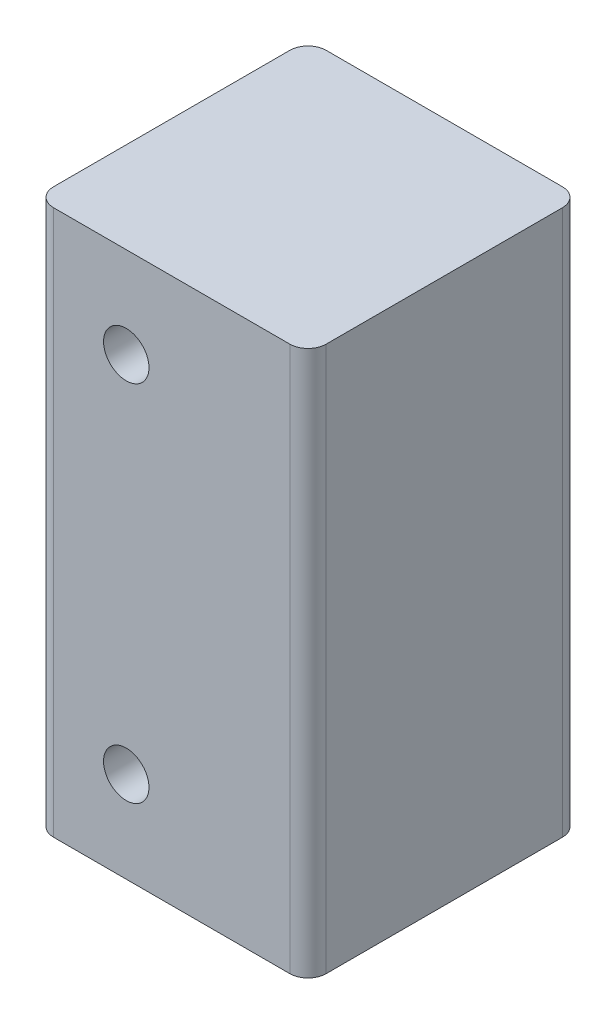
ISO-10303-21;
HEADER;
FILE_DESCRIPTION(('STEP AP214'),'2;1');
FILE_NAME('part.step','',(''),(''),'','','');
FILE_SCHEMA(('AUTOMOTIVE_DESIGN { 1 0 10303 214 1 1 1 1 }'));
ENDSEC;
DATA;
#1=APPLICATION_CONTEXT('core data for automotive mechanical design processes');
#2=APPLICATION_PROTOCOL_DEFINITION('international standard','automotive_design',2000,#1);
#3=PRODUCT_CONTEXT('',#1,'mechanical');
#4=PRODUCT('Part','Part','',(#3));
#5=PRODUCT_RELATED_PRODUCT_CATEGORY('part','',(#4));
#6=PRODUCT_DEFINITION_FORMATION('','',#4);
#7=PRODUCT_DEFINITION_CONTEXT('part definition',#1,'design');
#8=PRODUCT_DEFINITION('design','',#6,#7);
#9=PRODUCT_DEFINITION_SHAPE('','',#8);
#10=(LENGTH_UNIT() NAMED_UNIT(*) SI_UNIT(.MILLI.,.METRE.));
#11=(NAMED_UNIT(*) PLANE_ANGLE_UNIT() SI_UNIT($,.RADIAN.));
#12=(NAMED_UNIT(*) SI_UNIT($,.STERADIAN.) SOLID_ANGLE_UNIT());
#13=UNCERTAINTY_MEASURE_WITH_UNIT(LENGTH_MEASURE(1.E-05),#10,'distance_accuracy_value','');
#14=(GEOMETRIC_REPRESENTATION_CONTEXT(3) GLOBAL_UNCERTAINTY_ASSIGNED_CONTEXT((#13)) GLOBAL_UNIT_ASSIGNED_CONTEXT((#10,
#11,#12)) REPRESENTATION_CONTEXT('',''));
#15=CARTESIAN_POINT('',(0.,0.,0.));
#16=DIRECTION('',(0.,0.,1.));
#17=DIRECTION('',(1.,0.,0.));
#18=AXIS2_PLACEMENT_3D('',#15,#16,#17);
#19=CARTESIAN_POINT('',(0.,60.,30.));
#20=DIRECTION('',(0.,0.,-1.));
#21=DIRECTION('',(-1.,0.,0.));
#22=AXIS2_PLACEMENT_3D('',#19,#20,#21);
#23=PLANE('',#22);
#24=CARTESIAN_POINT('',(10.,50.,30.));
#25=DIRECTION('',(0.,0.,1.));
#26=DIRECTION('',(1.,0.,0.));
#27=AXIS2_PLACEMENT_3D('',#24,#25,#26);
#28=CIRCLE('',#27,2.5);
#29=CARTESIAN_POINT('',(12.5,50.,30.));
#30=VERTEX_POINT('',#29);
#31=EDGE_CURVE('E158',#30,#30,#28,.T.);
#32=ORIENTED_EDGE('',*,*,#31,.F.);
#33=EDGE_LOOP('',(#32));
#34=FACE_BOUND('',#33,.T.);
#35=DIRECTION('',(1.,0.,0.));
#36=VECTOR('',#35,1.);
#37=CARTESIAN_POINT('',(0.,0.,30.));
#38=LINE('',#37,#36);
#39=CARTESIAN_POINT('',(2.,0.,30.));
#40=VERTEX_POINT('',#39);
#41=CARTESIAN_POINT('',(28.,0.,30.));
#42=VERTEX_POINT('',#41);
#43=EDGE_CURVE('E102',#40,#42,#38,.T.);
#44=ORIENTED_EDGE('',*,*,#43,.T.);
#45=DIRECTION('',(0.,1.,0.));
#46=VECTOR('',#45,1.);
#47=CARTESIAN_POINT('',(28.,60.,30.));
#48=LINE('',#47,#46);
#49=CARTESIAN_POINT('',(28.,60.,30.));
#50=VERTEX_POINT('',#49);
#51=EDGE_CURVE('E11',#42,#50,#48,.T.);
#52=ORIENTED_EDGE('',*,*,#51,.T.);
#53=DIRECTION('',(-1.,0.,0.));
#54=VECTOR('',#53,1.);
#55=CARTESIAN_POINT('',(0.,60.,30.));
#56=LINE('',#55,#54);
#57=CARTESIAN_POINT('',(2.,60.,30.));
#58=VERTEX_POINT('',#57);
#59=EDGE_CURVE('E146',#50,#58,#56,.T.);
#60=ORIENTED_EDGE('',*,*,#59,.T.);
#61=DIRECTION('',(0.,-1.,0.));
#62=VECTOR('',#61,1.);
#63=CARTESIAN_POINT('',(2.,60.,30.));
#64=LINE('',#63,#62);
#65=EDGE_CURVE('E38',#58,#40,#64,.T.);
#66=ORIENTED_EDGE('',*,*,#65,.T.);
#67=EDGE_LOOP('',(#44,#52,#60,#66));
#68=FACE_BOUND('',#67,.T.);
#69=CARTESIAN_POINT('',(10.,10.,30.));
#70=DIRECTION('',(0.,0.,1.));
#71=DIRECTION('',(-1.,0.,0.));
#72=AXIS2_PLACEMENT_3D('',#69,#70,#71);
#73=CIRCLE('',#72,2.5);
#74=CARTESIAN_POINT('',(7.5,10.,30.));
#75=VERTEX_POINT('',#74);
#76=EDGE_CURVE('E221',#75,#75,#73,.T.);
#77=ORIENTED_EDGE('',*,*,#76,.F.);
#78=EDGE_LOOP('',(#77));
#79=FACE_BOUND('',#78,.T.);
#80=ADVANCED_FACE('F30',(#34,#68,#79),#23,.F.);
#81=CARTESIAN_POINT('',(0.,60.,0.));
#82=DIRECTION('',(0.,0.,-1.));
#83=DIRECTION('',(-1.,0.,0.));
#84=AXIS2_PLACEMENT_3D('',#81,#82,#83);
#85=PLANE('',#84);
#86=CARTESIAN_POINT('',(10.,50.,0.));
#87=DIRECTION('',(0.,0.,1.));
#88=DIRECTION('',(1.,0.,0.));
#89=AXIS2_PLACEMENT_3D('',#86,#87,#88);
#90=CIRCLE('',#89,2.5);
#91=CARTESIAN_POINT('',(12.5,50.,0.));
#92=VERTEX_POINT('',#91);
#93=EDGE_CURVE('E226',#92,#92,#90,.T.);
#94=ORIENTED_EDGE('',*,*,#93,.T.);
#95=EDGE_LOOP('',(#94));
#96=FACE_BOUND('',#95,.T.);
#97=DIRECTION('',(1.,0.,0.));
#98=VECTOR('',#97,1.);
#99=CARTESIAN_POINT('',(0.,0.,0.));
#100=LINE('',#99,#98);
#101=CARTESIAN_POINT('',(2.,0.,0.));
#102=VERTEX_POINT('',#101);
#103=CARTESIAN_POINT('',(28.,0.,0.));
#104=VERTEX_POINT('',#103);
#105=EDGE_CURVE('E155',#102,#104,#100,.T.);
#106=ORIENTED_EDGE('',*,*,#105,.F.);
#107=DIRECTION('',(0.,-1.,0.));
#108=VECTOR('',#107,1.);
#109=CARTESIAN_POINT('',(2.,60.,0.));
#110=LINE('',#109,#108);
#111=CARTESIAN_POINT('',(2.,60.,0.));
#112=VERTEX_POINT('',#111);
#113=EDGE_CURVE('E132',#102,#112,#110,.F.);
#114=ORIENTED_EDGE('',*,*,#113,.T.);
#115=DIRECTION('',(-1.,0.,0.));
#116=VECTOR('',#115,1.);
#117=CARTESIAN_POINT('',(0.,60.,0.));
#118=LINE('',#117,#116);
#119=CARTESIAN_POINT('',(28.,60.,0.));
#120=VERTEX_POINT('',#119);
#121=EDGE_CURVE('E151',#120,#112,#118,.T.);
#122=ORIENTED_EDGE('',*,*,#121,.F.);
#123=DIRECTION('',(0.,1.,0.));
#124=VECTOR('',#123,1.);
#125=CARTESIAN_POINT('',(28.,0.,0.));
#126=LINE('',#125,#124);
#127=EDGE_CURVE('E130',#120,#104,#126,.F.);
#128=ORIENTED_EDGE('',*,*,#127,.T.);
#129=EDGE_LOOP('',(#106,#114,#122,#128));
#130=FACE_BOUND('',#129,.T.);
#131=CARTESIAN_POINT('',(10.,10.,0.));
#132=DIRECTION('',(0.,0.,1.));
#133=DIRECTION('',(-1.,0.,0.));
#134=AXIS2_PLACEMENT_3D('',#131,#132,#133);
#135=CIRCLE('',#134,2.5);
#136=CARTESIAN_POINT('',(7.5,10.,0.));
#137=VERTEX_POINT('',#136);
#138=EDGE_CURVE('E224',#137,#137,#135,.T.);
#139=ORIENTED_EDGE('',*,*,#138,.T.);
#140=EDGE_LOOP('',(#139));
#141=FACE_BOUND('',#140,.T.);
#142=ADVANCED_FACE('F172',(#96,#130,#141),#85,.T.);
#143=CARTESIAN_POINT('',(0.,0.,30.));
#144=DIRECTION('',(1.,0.,0.));
#145=DIRECTION('',(0.,0.,-1.));
#146=AXIS2_PLACEMENT_3D('',#143,#144,#145);
#147=PLANE('',#146);
#148=DIRECTION('',(0.,0.,-1.));
#149=VECTOR('',#148,1.);
#150=CARTESIAN_POINT('',(0.,60.,30.));
#151=LINE('',#150,#149);
#152=CARTESIAN_POINT('',(0.,60.,28.));
#153=VERTEX_POINT('',#152);
#154=CARTESIAN_POINT('',(0.,60.,2.));
#155=VERTEX_POINT('',#154);
#156=EDGE_CURVE('E147',#153,#155,#151,.T.);
#157=ORIENTED_EDGE('',*,*,#156,.T.);
#158=DIRECTION('',(0.,-1.,0.));
#159=VECTOR('',#158,1.);
#160=CARTESIAN_POINT('',(0.,0.,2.));
#161=LINE('',#160,#159);
#162=CARTESIAN_POINT('',(0.,0.,2.));
#163=VERTEX_POINT('',#162);
#164=EDGE_CURVE('E108',#155,#163,#161,.T.);
#165=ORIENTED_EDGE('',*,*,#164,.T.);
#166=DIRECTION('',(0.,0.,-1.));
#167=VECTOR('',#166,1.);
#168=CARTESIAN_POINT('',(0.,0.,30.));
#169=LINE('',#168,#167);
#170=CARTESIAN_POINT('',(0.,0.,28.));
#171=VERTEX_POINT('',#170);
#172=EDGE_CURVE('E100',#171,#163,#169,.T.);
#173=ORIENTED_EDGE('',*,*,#172,.F.);
#174=DIRECTION('',(0.,-1.,0.));
#175=VECTOR('',#174,1.);
#176=CARTESIAN_POINT('',(0.,0.,28.));
#177=LINE('',#176,#175);
#178=EDGE_CURVE('E114',#171,#153,#177,.F.);
#179=ORIENTED_EDGE('',*,*,#178,.T.);
#180=EDGE_LOOP('',(#157,#165,#173,#179));
#181=FACE_BOUND('',#180,.T.);
#182=ADVANCED_FACE('F113',(#181),#147,.F.);
#183=CARTESIAN_POINT('',(0.,0.,30.));
#184=DIRECTION('',(0.,1.,0.));
#185=DIRECTION('',(0.,0.,1.));
#186=AXIS2_PLACEMENT_3D('',#183,#184,#185);
#187=PLANE('',#186);
#188=ORIENTED_EDGE('',*,*,#172,.T.);
#189=CARTESIAN_POINT('',(2.,0.,2.));
#190=DIRECTION('',(0.,1.,0.));
#191=DIRECTION('',(0.,0.,1.));
#192=AXIS2_PLACEMENT_3D('',#189,#190,#191);
#193=CIRCLE('',#192,2.);
#194=EDGE_CURVE('E128',#163,#102,#193,.F.);
#195=ORIENTED_EDGE('',*,*,#194,.T.);
#196=ORIENTED_EDGE('',*,*,#105,.T.);
#197=CARTESIAN_POINT('',(28.,0.,2.));
#198=DIRECTION('',(0.,1.,0.));
#199=DIRECTION('',(0.,0.,1.));
#200=AXIS2_PLACEMENT_3D('',#197,#198,#199);
#201=CIRCLE('',#200,2.);
#202=CARTESIAN_POINT('',(30.,0.,2.));
#203=VERTEX_POINT('',#202);
#204=EDGE_CURVE('E126',#104,#203,#201,.F.);
#205=ORIENTED_EDGE('',*,*,#204,.T.);
#206=DIRECTION('',(0.,0.,-1.));
#207=VECTOR('',#206,1.);
#208=CARTESIAN_POINT('',(30.,0.,30.));
#209=LINE('',#208,#207);
#210=CARTESIAN_POINT('',(30.,0.,28.));
#211=VERTEX_POINT('',#210);
#212=EDGE_CURVE('E117',#211,#203,#209,.T.);
#213=ORIENTED_EDGE('',*,*,#212,.F.);
#214=CARTESIAN_POINT('',(28.,0.,28.));
#215=DIRECTION('',(0.,1.,0.));
#216=DIRECTION('',(0.,0.,1.));
#217=AXIS2_PLACEMENT_3D('',#214,#215,#216);
#218=CIRCLE('',#217,2.);
#219=EDGE_CURVE('E107',#211,#42,#218,.F.);
#220=ORIENTED_EDGE('',*,*,#219,.T.);
#221=ORIENTED_EDGE('',*,*,#43,.F.);
#222=CARTESIAN_POINT('',(2.,0.,28.));
#223=DIRECTION('',(0.,1.,0.));
#224=DIRECTION('',(0.,0.,1.));
#225=AXIS2_PLACEMENT_3D('',#222,#223,#224);
#226=CIRCLE('',#225,2.);
#227=EDGE_CURVE('E97',#40,#171,#226,.F.);
#228=ORIENTED_EDGE('',*,*,#227,.T.);
#229=EDGE_LOOP('',(#188,#195,#196,#205,#213,#220,#221,#228));
#230=FACE_BOUND('',#229,.T.);
#231=ADVANCED_FACE('F99',(#230),#187,.F.);
#232=CARTESIAN_POINT('',(30.,0.,30.));
#233=DIRECTION('',(-1.,0.,0.));
#234=DIRECTION('',(0.,0.,1.));
#235=AXIS2_PLACEMENT_3D('',#232,#233,#234);
#236=PLANE('',#235);
#237=ORIENTED_EDGE('',*,*,#212,.T.);
#238=DIRECTION('',(0.,1.,0.));
#239=VECTOR('',#238,1.);
#240=CARTESIAN_POINT('',(30.,60.,2.));
#241=LINE('',#240,#239);
#242=CARTESIAN_POINT('',(30.,60.,2.));
#243=VERTEX_POINT('',#242);
#244=EDGE_CURVE('E141',#203,#243,#241,.T.);
#245=ORIENTED_EDGE('',*,*,#244,.T.);
#246=DIRECTION('',(0.,0.,-1.));
#247=VECTOR('',#246,1.);
#248=CARTESIAN_POINT('',(30.,60.,30.));
#249=LINE('',#248,#247);
#250=CARTESIAN_POINT('',(30.,60.,28.));
#251=VERTEX_POINT('',#250);
#252=EDGE_CURVE('E149',#251,#243,#249,.T.);
#253=ORIENTED_EDGE('',*,*,#252,.F.);
#254=DIRECTION('',(0.,1.,0.));
#255=VECTOR('',#254,1.);
#256=CARTESIAN_POINT('',(30.,0.,28.));
#257=LINE('',#256,#255);
#258=EDGE_CURVE('E139',#251,#211,#257,.F.);
#259=ORIENTED_EDGE('',*,*,#258,.T.);
#260=EDGE_LOOP('',(#237,#245,#253,#259));
#261=FACE_BOUND('',#260,.T.);
#262=ADVANCED_FACE('F164',(#261),#236,.F.);
#263=CARTESIAN_POINT('',(0.,60.,30.));
#264=DIRECTION('',(0.,-1.,0.));
#265=DIRECTION('',(0.,0.,-1.));
#266=AXIS2_PLACEMENT_3D('',#263,#264,#265);
#267=PLANE('',#266);
#268=ORIENTED_EDGE('',*,*,#121,.T.);
#269=CARTESIAN_POINT('',(2.,60.,2.));
#270=DIRECTION('',(0.,-1.,0.));
#271=DIRECTION('',(0.,0.,-1.));
#272=AXIS2_PLACEMENT_3D('',#269,#270,#271);
#273=CIRCLE('',#272,2.);
#274=EDGE_CURVE('E137',#112,#155,#273,.F.);
#275=ORIENTED_EDGE('',*,*,#274,.T.);
#276=ORIENTED_EDGE('',*,*,#156,.F.);
#277=CARTESIAN_POINT('',(2.,60.,28.));
#278=DIRECTION('',(0.,-1.,0.));
#279=DIRECTION('',(0.,0.,-1.));
#280=AXIS2_PLACEMENT_3D('',#277,#278,#279);
#281=CIRCLE('',#280,2.);
#282=EDGE_CURVE('E120',#153,#58,#281,.F.);
#283=ORIENTED_EDGE('',*,*,#282,.T.);
#284=ORIENTED_EDGE('',*,*,#59,.F.);
#285=CARTESIAN_POINT('',(28.,60.,28.));
#286=DIRECTION('',(0.,-1.,0.));
#287=DIRECTION('',(0.,0.,-1.));
#288=AXIS2_PLACEMENT_3D('',#285,#286,#287);
#289=CIRCLE('',#288,2.);
#290=EDGE_CURVE('E53',#50,#251,#289,.F.);
#291=ORIENTED_EDGE('',*,*,#290,.T.);
#292=ORIENTED_EDGE('',*,*,#252,.T.);
#293=CARTESIAN_POINT('',(28.,60.,2.));
#294=DIRECTION('',(0.,-1.,0.));
#295=DIRECTION('',(0.,0.,-1.));
#296=AXIS2_PLACEMENT_3D('',#293,#294,#295);
#297=CIRCLE('',#296,2.);
#298=EDGE_CURVE('E45',#243,#120,#297,.F.);
#299=ORIENTED_EDGE('',*,*,#298,.T.);
#300=EDGE_LOOP('',(#268,#275,#276,#283,#284,#291,#292,#299));
#301=FACE_BOUND('',#300,.T.);
#302=ADVANCED_FACE('F178',(#301),#267,.F.);
#303=CARTESIAN_POINT('',(10.,50.,30.));
#304=DIRECTION('',(0.,0.,-1.));
#305=DIRECTION('',(-1.,0.,0.));
#306=AXIS2_PLACEMENT_3D('',#303,#304,#305);
#307=CYLINDRICAL_SURFACE('',#306,2.5);
#308=ORIENTED_EDGE('',*,*,#31,.T.);
#309=EDGE_LOOP('',(#308));
#310=FACE_BOUND('',#309,.T.);
#311=ORIENTED_EDGE('',*,*,#93,.F.);
#312=EDGE_LOOP('',(#311));
#313=FACE_BOUND('',#312,.T.);
#314=ADVANCED_FACE('F197',(#310,#313),#307,.F.);
#315=CARTESIAN_POINT('',(10.,10.,30.));
#316=DIRECTION('',(0.,0.,-1.));
#317=DIRECTION('',(-1.,0.,0.));
#318=AXIS2_PLACEMENT_3D('',#315,#316,#317);
#319=CYLINDRICAL_SURFACE('',#318,2.5);
#320=ORIENTED_EDGE('',*,*,#76,.T.);
#321=EDGE_LOOP('',(#320));
#322=FACE_BOUND('',#321,.T.);
#323=ORIENTED_EDGE('',*,*,#138,.F.);
#324=EDGE_LOOP('',(#323));
#325=FACE_BOUND('',#324,.T.);
#326=ADVANCED_FACE('F209',(#322,#325),#319,.F.);
#327=CARTESIAN_POINT('',(2.,0.,2.));
#328=DIRECTION('',(0.,1.,0.));
#329=DIRECTION('',(0.,0.,1.));
#330=AXIS2_PLACEMENT_3D('',#327,#328,#329);
#331=CYLINDRICAL_SURFACE('',#330,2.);
#332=ORIENTED_EDGE('',*,*,#274,.F.);
#333=ORIENTED_EDGE('',*,*,#113,.F.);
#334=ORIENTED_EDGE('',*,*,#194,.F.);
#335=ORIENTED_EDGE('',*,*,#164,.F.);
#336=EDGE_LOOP('',(#332,#333,#334,#335));
#337=FACE_BOUND('',#336,.T.);
#338=ADVANCED_FACE('F177',(#337),#331,.T.);
#339=CARTESIAN_POINT('',(28.,0.,2.));
#340=DIRECTION('',(0.,-1.,0.));
#341=DIRECTION('',(0.,0.,-1.));
#342=AXIS2_PLACEMENT_3D('',#339,#340,#341);
#343=CYLINDRICAL_SURFACE('',#342,2.);
#344=ORIENTED_EDGE('',*,*,#204,.F.);
#345=ORIENTED_EDGE('',*,*,#127,.F.);
#346=ORIENTED_EDGE('',*,*,#298,.F.);
#347=ORIENTED_EDGE('',*,*,#244,.F.);
#348=EDGE_LOOP('',(#344,#345,#346,#347));
#349=FACE_BOUND('',#348,.T.);
#350=ADVANCED_FACE('F168',(#349),#343,.T.);
#351=CARTESIAN_POINT('',(28.,60.,28.));
#352=DIRECTION('',(0.,1.,0.));
#353=DIRECTION('',(0.,0.,1.));
#354=AXIS2_PLACEMENT_3D('',#351,#352,#353);
#355=CYLINDRICAL_SURFACE('',#354,2.);
#356=ORIENTED_EDGE('',*,*,#219,.F.);
#357=ORIENTED_EDGE('',*,*,#258,.F.);
#358=ORIENTED_EDGE('',*,*,#290,.F.);
#359=ORIENTED_EDGE('',*,*,#51,.F.);
#360=EDGE_LOOP('',(#356,#357,#358,#359));
#361=FACE_BOUND('',#360,.T.);
#362=ADVANCED_FACE('F180',(#361),#355,.T.);
#363=CARTESIAN_POINT('',(2.,60.,28.));
#364=DIRECTION('',(0.,-1.,0.));
#365=DIRECTION('',(0.,0.,-1.));
#366=AXIS2_PLACEMENT_3D('',#363,#364,#365);
#367=CYLINDRICAL_SURFACE('',#366,2.);
#368=ORIENTED_EDGE('',*,*,#282,.F.);
#369=ORIENTED_EDGE('',*,*,#178,.F.);
#370=ORIENTED_EDGE('',*,*,#227,.F.);
#371=ORIENTED_EDGE('',*,*,#65,.F.);
#372=EDGE_LOOP('',(#368,#369,#370,#371));
#373=FACE_BOUND('',#372,.T.);
#374=ADVANCED_FACE('F32',(#373),#367,.T.);
#375=CLOSED_SHELL('',(#80,#142,#182,#231,#262,#302,#314,#326,#338,#350,#362,#374));
#376=MANIFOLD_SOLID_BREP('B2',#375);
#377=ADVANCED_BREP_SHAPE_REPRESENTATION('',(#18,#376),#14);
#378=SHAPE_DEFINITION_REPRESENTATION(#9,#377);
ENDSEC;
END-ISO-10303-21;
